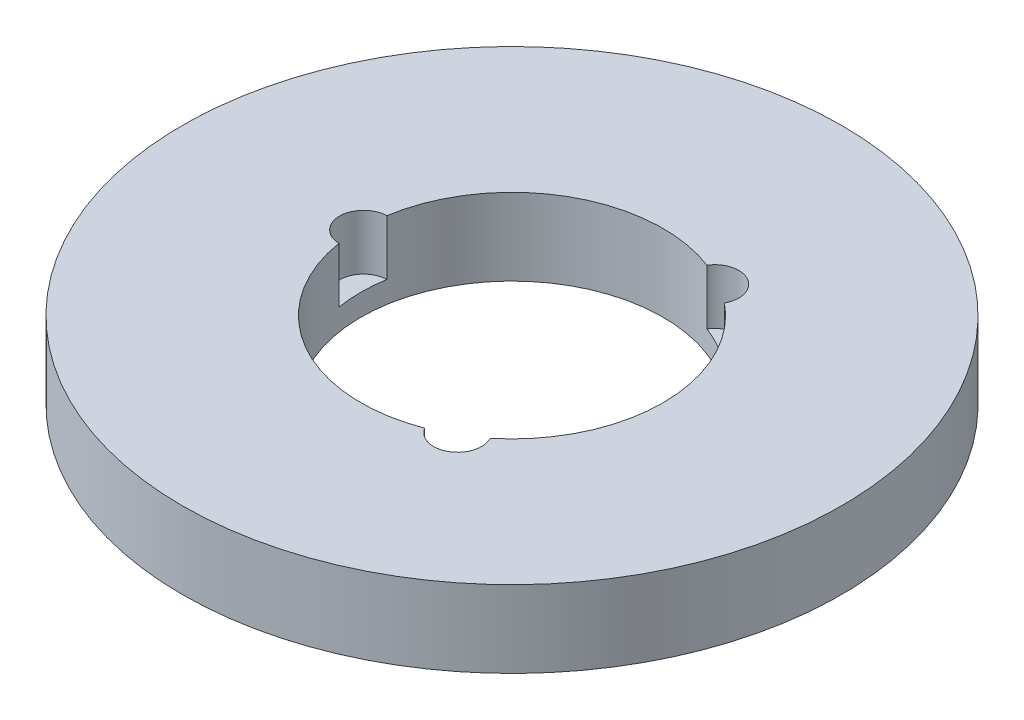
ISO-10303-21;
HEADER;
FILE_DESCRIPTION(('STEP AP214'),'2;1');
FILE_NAME('part.step','',(''),(''),'','','');
FILE_SCHEMA(('AUTOMOTIVE_DESIGN { 1 0 10303 214 1 1 1 1 }'));
ENDSEC;
DATA;
#1=APPLICATION_CONTEXT('core data for automotive mechanical design processes');
#2=APPLICATION_PROTOCOL_DEFINITION('international standard','automotive_design',2000,#1);
#3=PRODUCT_CONTEXT('',#1,'mechanical');
#4=PRODUCT('Part','Part','',(#3));
#5=PRODUCT_RELATED_PRODUCT_CATEGORY('part','',(#4));
#6=PRODUCT_DEFINITION_FORMATION('','',#4);
#7=PRODUCT_DEFINITION_CONTEXT('part definition',#1,'design');
#8=PRODUCT_DEFINITION('design','',#6,#7);
#9=PRODUCT_DEFINITION_SHAPE('','',#8);
#10=(LENGTH_UNIT() NAMED_UNIT(*) SI_UNIT(.MILLI.,.METRE.));
#11=(NAMED_UNIT(*) PLANE_ANGLE_UNIT() SI_UNIT($,.RADIAN.));
#12=(NAMED_UNIT(*) SI_UNIT($,.STERADIAN.) SOLID_ANGLE_UNIT());
#13=UNCERTAINTY_MEASURE_WITH_UNIT(LENGTH_MEASURE(1.E-05),#10,'distance_accuracy_value','');
#14=(GEOMETRIC_REPRESENTATION_CONTEXT(3) GLOBAL_UNCERTAINTY_ASSIGNED_CONTEXT((#13)) GLOBAL_UNIT_ASSIGNED_CONTEXT((#10,
#11,#12)) REPRESENTATION_CONTEXT('',''));
#15=CARTESIAN_POINT('',(0.,0.,0.));
#16=DIRECTION('',(0.,0.,1.));
#17=DIRECTION('',(1.,0.,0.));
#18=AXIS2_PLACEMENT_3D('',#15,#16,#17);
#19=CARTESIAN_POINT('',(0.,14.,0.));
#20=DIRECTION('',(0.,-1.,0.));
#21=DIRECTION('',(0.,0.,-1.));
#22=AXIS2_PLACEMENT_3D('',#19,#20,#21);
#23=CYLINDRICAL_SURFACE('',#22,60.);
#24=CARTESIAN_POINT('',(0.,14.,0.));
#25=DIRECTION('',(0.,1.,0.));
#26=DIRECTION('',(0.,0.,1.));
#27=AXIS2_PLACEMENT_3D('',#24,#25,#26);
#28=CIRCLE('',#27,60.);
#29=CARTESIAN_POINT('',(0.,14.,60.));
#30=VERTEX_POINT('',#29);
#31=EDGE_CURVE('E130',#30,#30,#28,.T.);
#32=ORIENTED_EDGE('',*,*,#31,.F.);
#33=EDGE_LOOP('',(#32));
#34=FACE_BOUND('',#33,.T.);
#35=CARTESIAN_POINT('',(0.,0.,0.));
#36=DIRECTION('',(0.,1.,0.));
#37=DIRECTION('',(0.,0.,1.));
#38=AXIS2_PLACEMENT_3D('',#35,#36,#37);
#39=CIRCLE('',#38,60.);
#40=CARTESIAN_POINT('',(0.,0.,60.));
#41=VERTEX_POINT('',#40);
#42=EDGE_CURVE('E117',#41,#41,#39,.T.);
#43=ORIENTED_EDGE('',*,*,#42,.T.);
#44=EDGE_LOOP('',(#43));
#45=FACE_BOUND('',#44,.T.);
#46=ADVANCED_FACE('F39',(#34,#45),#23,.T.);
#47=CARTESIAN_POINT('',(0.,14.,0.));
#48=DIRECTION('',(0.,1.,0.));
#49=DIRECTION('',(0.,0.,1.));
#50=AXIS2_PLACEMENT_3D('',#47,#48,#49);
#51=PLANE('',#50);
#52=CARTESIAN_POINT('',(13.5171399472023,14.,23.412373161573));
#53=DIRECTION('',(0.,1.,0.));
#54=DIRECTION('',(0.866025403784436,0.,-0.500000000000004));
#55=AXIS2_PLACEMENT_3D('',#52,#53,#54);
#56=CIRCLE('',#55,4.3631012741584);
#57=CARTESIAN_POINT('',(9.79878129847434,14.,25.6950167360263));
#58=VERTEX_POINT('',#57);
#59=CARTESIAN_POINT('',(17.3531465948281,14.,21.3335018986196));
#60=VERTEX_POINT('',#59);
#61=EDGE_CURVE('E148',#58,#60,#56,.T.);
#62=ORIENTED_EDGE('',*,*,#61,.F.);
#63=CARTESIAN_POINT('',(0.,14.,0.));
#64=DIRECTION('',(0.,1.,0.));
#65=DIRECTION('',(0.,0.,1.));
#66=AXIS2_PLACEMENT_3D('',#63,#64,#65);
#67=CIRCLE('',#66,27.5);
#68=CARTESIAN_POINT('',(-27.1519278933022,14.,4.36151483740661));
#69=VERTEX_POINT('',#68);
#70=EDGE_CURVE('E113',#69,#58,#67,.T.);
#71=ORIENTED_EDGE('',*,*,#70,.F.);
#72=CARTESIAN_POINT('',(-27.0342798944044,14.,0.));
#73=DIRECTION('',(0.,1.,0.));
#74=DIRECTION('',(0.,0.,1.));
#75=AXIS2_PLACEMENT_3D('',#72,#73,#74);
#76=CIRCLE('',#75,4.3631012741584);
#77=CARTESIAN_POINT('',(-27.1519278933022,14.,-4.36151483740661));
#78=VERTEX_POINT('',#77);
#79=EDGE_CURVE('E125',#78,#69,#76,.T.);
#80=ORIENTED_EDGE('',*,*,#79,.F.);
#81=CARTESIAN_POINT('',(9.79878129847399,14.,-25.6950167360264));
#82=VERTEX_POINT('',#81);
#83=EDGE_CURVE('E107',#82,#78,#67,.T.);
#84=ORIENTED_EDGE('',*,*,#83,.F.);
#85=CARTESIAN_POINT('',(13.517139947202,14.,-23.4123731615732));
#86=DIRECTION('',(0.,1.,0.));
#87=DIRECTION('',(-0.866025403784443,0.,-0.499999999999992));
#88=AXIS2_PLACEMENT_3D('',#85,#86,#87);
#89=CIRCLE('',#88,4.3631012741584);
#90=CARTESIAN_POINT('',(17.3531465948278,14.,-21.3335018986199));
#91=VERTEX_POINT('',#90);
#92=EDGE_CURVE('E95',#91,#82,#89,.T.);
#93=ORIENTED_EDGE('',*,*,#92,.F.);
#94=EDGE_CURVE('E106',#60,#91,#67,.T.);
#95=ORIENTED_EDGE('',*,*,#94,.F.);
#96=EDGE_LOOP('',(#62,#71,#80,#84,#93,#95));
#97=FACE_BOUND('',#96,.T.);
#98=ORIENTED_EDGE('',*,*,#31,.T.);
#99=EDGE_LOOP('',(#98));
#100=FACE_BOUND('',#99,.T.);
#101=ADVANCED_FACE('F102',(#97,#100),#51,.T.);
#102=CARTESIAN_POINT('',(0.,0.,0.));
#103=DIRECTION('',(0.,1.,0.));
#104=DIRECTION('',(0.,0.,1.));
#105=AXIS2_PLACEMENT_3D('',#102,#103,#104);
#106=PLANE('',#105);
#107=CARTESIAN_POINT('',(0.,0.,0.));
#108=DIRECTION('',(0.,1.,0.));
#109=DIRECTION('',(0.,0.,1.));
#110=AXIS2_PLACEMENT_3D('',#107,#108,#109);
#111=CIRCLE('',#110,27.5);
#112=CARTESIAN_POINT('',(0.,0.,27.5));
#113=VERTEX_POINT('',#112);
#114=EDGE_CURVE('E118',#113,#113,#111,.T.);
#115=ORIENTED_EDGE('',*,*,#114,.T.);
#116=EDGE_LOOP('',(#115));
#117=FACE_BOUND('',#116,.T.);
#118=ORIENTED_EDGE('',*,*,#42,.F.);
#119=EDGE_LOOP('',(#118));
#120=FACE_BOUND('',#119,.T.);
#121=ADVANCED_FACE('F161',(#117,#120),#106,.F.);
#122=CARTESIAN_POINT('',(0.,14.,0.));
#123=DIRECTION('',(0.,-1.,0.));
#124=DIRECTION('',(0.,0.,-1.));
#125=AXIS2_PLACEMENT_3D('',#122,#123,#124);
#126=CYLINDRICAL_SURFACE('',#125,27.5);
#127=DIRECTION('',(0.,1.,0.));
#128=VECTOR('',#127,1.);
#129=CARTESIAN_POINT('',(9.79878129847434,8.97179528436369,25.6950167360263));
#130=LINE('',#129,#128);
#131=CARTESIAN_POINT('',(9.79878129847434,3.94359056872739,25.6950167360263));
#132=VERTEX_POINT('',#131);
#133=EDGE_CURVE('E11',#132,#58,#130,.T.);
#134=ORIENTED_EDGE('',*,*,#133,.F.);
#135=CARTESIAN_POINT('',(0.,3.94359056872739,0.));
#136=DIRECTION('',(0.,1.,0.));
#137=DIRECTION('',(0.,0.,1.));
#138=AXIS2_PLACEMENT_3D('',#135,#136,#137);
#139=CIRCLE('',#138,27.5);
#140=CARTESIAN_POINT('',(17.3531465948281,3.94359056872739,21.3335018986196));
#141=VERTEX_POINT('',#140);
#142=EDGE_CURVE('E100',#132,#141,#139,.T.);
#143=ORIENTED_EDGE('',*,*,#142,.T.);
#144=DIRECTION('',(0.,1.,0.));
#145=VECTOR('',#144,1.);
#146=CARTESIAN_POINT('',(17.3531465948281,8.97179528436369,21.3335018986196));
#147=LINE('',#146,#145);
#148=EDGE_CURVE('E46',#60,#141,#147,.F.);
#149=ORIENTED_EDGE('',*,*,#148,.F.);
#150=ORIENTED_EDGE('',*,*,#94,.T.);
#151=DIRECTION('',(0.,1.,0.));
#152=VECTOR('',#151,1.);
#153=CARTESIAN_POINT('',(17.3531465948278,8.97179528436369,-21.3335018986199));
#154=LINE('',#153,#152);
#155=CARTESIAN_POINT('',(17.3531465948278,3.94359056872739,-21.3335018986199));
#156=VERTEX_POINT('',#155);
#157=EDGE_CURVE('E90',#156,#91,#154,.T.);
#158=ORIENTED_EDGE('',*,*,#157,.F.);
#159=CARTESIAN_POINT('',(0.,3.94359056872739,0.));
#160=DIRECTION('',(0.,1.,0.));
#161=DIRECTION('',(0.,0.,1.));
#162=AXIS2_PLACEMENT_3D('',#159,#160,#161);
#163=CIRCLE('',#162,27.5);
#164=CARTESIAN_POINT('',(9.79878129847399,3.94359056872739,-25.6950167360264));
#165=VERTEX_POINT('',#164);
#166=EDGE_CURVE('E143',#156,#165,#163,.T.);
#167=ORIENTED_EDGE('',*,*,#166,.T.);
#168=DIRECTION('',(0.,1.,0.));
#169=VECTOR('',#168,1.);
#170=CARTESIAN_POINT('',(9.79878129847399,8.97179528436369,-25.6950167360264));
#171=LINE('',#170,#169);
#172=EDGE_CURVE('E98',#82,#165,#171,.F.);
#173=ORIENTED_EDGE('',*,*,#172,.F.);
#174=ORIENTED_EDGE('',*,*,#83,.T.);
#175=DIRECTION('',(0.,1.,0.));
#176=VECTOR('',#175,1.);
#177=CARTESIAN_POINT('',(-27.1519278933022,8.97179528436369,-4.36151483740661));
#178=LINE('',#177,#176);
#179=CARTESIAN_POINT('',(-27.1519278933022,3.94359056872739,-4.36151483740661));
#180=VERTEX_POINT('',#179);
#181=EDGE_CURVE('E137',#180,#78,#178,.T.);
#182=ORIENTED_EDGE('',*,*,#181,.F.);
#183=CARTESIAN_POINT('',(0.,3.94359056872739,0.));
#184=DIRECTION('',(0.,1.,0.));
#185=DIRECTION('',(0.,0.,1.));
#186=AXIS2_PLACEMENT_3D('',#183,#184,#185);
#187=CIRCLE('',#186,27.5);
#188=CARTESIAN_POINT('',(-27.1519278933022,3.94359056872739,4.36151483740661));
#189=VERTEX_POINT('',#188);
#190=EDGE_CURVE('E128',#180,#189,#187,.T.);
#191=ORIENTED_EDGE('',*,*,#190,.T.);
#192=DIRECTION('',(0.,1.,0.));
#193=VECTOR('',#192,1.);
#194=CARTESIAN_POINT('',(-27.1519278933022,8.97179528436369,4.36151483740661));
#195=LINE('',#194,#193);
#196=EDGE_CURVE('E134',#69,#189,#195,.F.);
#197=ORIENTED_EDGE('',*,*,#196,.F.);
#198=ORIENTED_EDGE('',*,*,#70,.T.);
#199=EDGE_LOOP('',(#134,#143,#149,#150,#158,#167,#173,#174,#182,#191,#197,#198));
#200=FACE_BOUND('',#199,.T.);
#201=ORIENTED_EDGE('',*,*,#114,.F.);
#202=EDGE_LOOP('',(#201));
#203=FACE_BOUND('',#202,.T.);
#204=ADVANCED_FACE('F115',(#200,#203),#126,.F.);
#205=CARTESIAN_POINT('',(-27.0342798944044,3.94359056872739,0.));
#206=DIRECTION('',(0.,1.,0.));
#207=DIRECTION('',(0.,0.,1.));
#208=AXIS2_PLACEMENT_3D('',#205,#206,#207);
#209=CYLINDRICAL_SURFACE('',#208,4.3631012741584);
#210=ORIENTED_EDGE('',*,*,#181,.T.);
#211=ORIENTED_EDGE('',*,*,#79,.T.);
#212=ORIENTED_EDGE('',*,*,#196,.T.);
#213=CARTESIAN_POINT('',(-27.0342798944044,3.94359056872739,0.));
#214=DIRECTION('',(0.,1.,0.));
#215=DIRECTION('',(0.,0.,1.));
#216=AXIS2_PLACEMENT_3D('',#213,#214,#215);
#217=CIRCLE('',#216,4.3631012741584);
#218=EDGE_CURVE('E127',#180,#189,#217,.T.);
#219=ORIENTED_EDGE('',*,*,#218,.F.);
#220=EDGE_LOOP('',(#210,#211,#212,#219));
#221=FACE_BOUND('',#220,.T.);
#222=ADVANCED_FACE('F175',(#221),#209,.F.);
#223=CARTESIAN_POINT('',(-27.0342798944044,3.94359056872739,0.));
#224=DIRECTION('',(0.,1.,0.));
#225=DIRECTION('',(0.,0.,1.));
#226=AXIS2_PLACEMENT_3D('',#223,#224,#225);
#227=PLANE('',#226);
#228=ORIENTED_EDGE('',*,*,#218,.T.);
#229=ORIENTED_EDGE('',*,*,#190,.F.);
#230=EDGE_LOOP('',(#228,#229));
#231=FACE_BOUND('',#230,.T.);
#232=ADVANCED_FACE('F176',(#231),#227,.T.);
#233=CARTESIAN_POINT('',(13.517139947202,3.94359056872739,-23.4123731615732));
#234=DIRECTION('',(0.,1.,0.));
#235=DIRECTION('',(0.,0.,1.));
#236=AXIS2_PLACEMENT_3D('',#233,#234,#235);
#237=CYLINDRICAL_SURFACE('',#236,4.3631012741584);
#238=ORIENTED_EDGE('',*,*,#157,.T.);
#239=ORIENTED_EDGE('',*,*,#92,.T.);
#240=ORIENTED_EDGE('',*,*,#172,.T.);
#241=CARTESIAN_POINT('',(13.517139947202,3.94359056872739,-23.4123731615732));
#242=DIRECTION('',(0.,1.,0.));
#243=DIRECTION('',(-0.866025403784443,0.,-0.499999999999992));
#244=AXIS2_PLACEMENT_3D('',#241,#242,#243);
#245=CIRCLE('',#244,4.3631012741584);
#246=EDGE_CURVE('E56',#156,#165,#245,.T.);
#247=ORIENTED_EDGE('',*,*,#246,.F.);
#248=EDGE_LOOP('',(#238,#239,#240,#247));
#249=FACE_BOUND('',#248,.T.);
#250=ADVANCED_FACE('F93',(#249),#237,.F.);
#251=CARTESIAN_POINT('',(13.517139947202,3.94359056872739,-23.4123731615732));
#252=DIRECTION('',(0.,1.,0.));
#253=DIRECTION('',(-0.866025403784443,0.,-0.499999999999992));
#254=AXIS2_PLACEMENT_3D('',#251,#252,#253);
#255=PLANE('',#254);
#256=ORIENTED_EDGE('',*,*,#246,.T.);
#257=ORIENTED_EDGE('',*,*,#166,.F.);
#258=EDGE_LOOP('',(#256,#257));
#259=FACE_BOUND('',#258,.T.);
#260=ADVANCED_FACE('F153',(#259),#255,.T.);
#261=CARTESIAN_POINT('',(13.5171399472023,3.94359056872739,23.412373161573));
#262=DIRECTION('',(0.,1.,0.));
#263=DIRECTION('',(0.,0.,1.));
#264=AXIS2_PLACEMENT_3D('',#261,#262,#263);
#265=CYLINDRICAL_SURFACE('',#264,4.3631012741584);
#266=ORIENTED_EDGE('',*,*,#133,.T.);
#267=ORIENTED_EDGE('',*,*,#61,.T.);
#268=ORIENTED_EDGE('',*,*,#148,.T.);
#269=CARTESIAN_POINT('',(13.5171399472023,3.94359056872739,23.412373161573));
#270=DIRECTION('',(0.,1.,0.));
#271=DIRECTION('',(0.866025403784436,0.,-0.500000000000004));
#272=AXIS2_PLACEMENT_3D('',#269,#270,#271);
#273=CIRCLE('',#272,4.3631012741584);
#274=EDGE_CURVE('E55',#132,#141,#273,.T.);
#275=ORIENTED_EDGE('',*,*,#274,.F.);
#276=EDGE_LOOP('',(#266,#267,#268,#275));
#277=FACE_BOUND('',#276,.T.);
#278=ADVANCED_FACE('F144',(#277),#265,.F.);
#279=CARTESIAN_POINT('',(13.5171399472023,3.94359056872739,23.412373161573));
#280=DIRECTION('',(0.,1.,0.));
#281=DIRECTION('',(0.866025403784436,0.,-0.500000000000004));
#282=AXIS2_PLACEMENT_3D('',#279,#280,#281);
#283=PLANE('',#282);
#284=ORIENTED_EDGE('',*,*,#274,.T.);
#285=ORIENTED_EDGE('',*,*,#142,.F.);
#286=EDGE_LOOP('',(#284,#285));
#287=FACE_BOUND('',#286,.T.);
#288=ADVANCED_FACE('F150',(#287),#283,.T.);
#289=CLOSED_SHELL('',(#46,#101,#121,#204,#222,#232,#250,#260,#278,#288));
#290=MANIFOLD_SOLID_BREP('B2',#289);
#291=ADVANCED_BREP_SHAPE_REPRESENTATION('',(#18,#290),#14);
#292=SHAPE_DEFINITION_REPRESENTATION(#9,#291);
ENDSEC;
END-ISO-10303-21;
